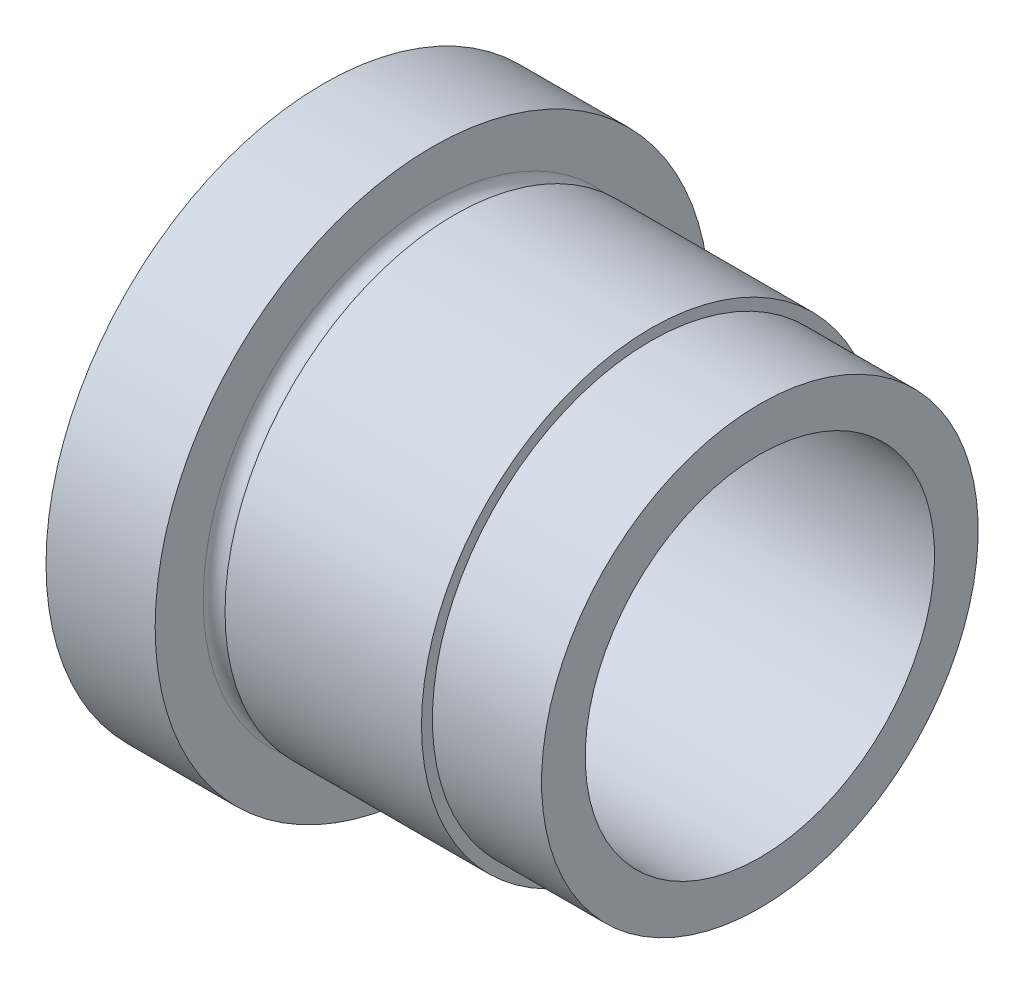
ISO-10303-21;
HEADER;
FILE_DESCRIPTION(('STEP AP214'),'2;1');
FILE_NAME('part.step','',(''),(''),'','','');
FILE_SCHEMA(('AUTOMOTIVE_DESIGN { 1 0 10303 214 1 1 1 1 }'));
ENDSEC;
DATA;
#1=APPLICATION_CONTEXT('core data for automotive mechanical design processes');
#2=APPLICATION_PROTOCOL_DEFINITION('international standard','automotive_design',2000,#1);
#3=PRODUCT_CONTEXT('',#1,'mechanical');
#4=PRODUCT('Part','Part','',(#3));
#5=PRODUCT_RELATED_PRODUCT_CATEGORY('part','',(#4));
#6=PRODUCT_DEFINITION_FORMATION('','',#4);
#7=PRODUCT_DEFINITION_CONTEXT('part definition',#1,'design');
#8=PRODUCT_DEFINITION('design','',#6,#7);
#9=PRODUCT_DEFINITION_SHAPE('','',#8);
#10=(LENGTH_UNIT() NAMED_UNIT(*) SI_UNIT(.MILLI.,.METRE.));
#11=(NAMED_UNIT(*) PLANE_ANGLE_UNIT() SI_UNIT($,.RADIAN.));
#12=(NAMED_UNIT(*) SI_UNIT($,.STERADIAN.) SOLID_ANGLE_UNIT());
#13=UNCERTAINTY_MEASURE_WITH_UNIT(LENGTH_MEASURE(1.E-05),#10,'distance_accuracy_value','');
#14=(GEOMETRIC_REPRESENTATION_CONTEXT(3) GLOBAL_UNCERTAINTY_ASSIGNED_CONTEXT((#13)) GLOBAL_UNIT_ASSIGNED_CONTEXT((#10,
#11,#12)) REPRESENTATION_CONTEXT('',''));
#15=CARTESIAN_POINT('',(0.,0.,0.));
#16=DIRECTION('',(0.,0.,1.));
#17=DIRECTION('',(1.,0.,0.));
#18=AXIS2_PLACEMENT_3D('',#15,#16,#17);
#19=CARTESIAN_POINT('',(-138.925343642612,0.,0.));
#20=DIRECTION('',(-1.,0.,0.));
#21=DIRECTION('',(0.,-1.,0.));
#22=AXIS2_PLACEMENT_3D('',#19,#20,#21);
#23=CYLINDRICAL_SURFACE('',#22,12.7);
#24=CARTESIAN_POINT('',(0.,0.,0.));
#25=DIRECTION('',(-1.,0.,0.));
#26=DIRECTION('',(0.,-1.,0.));
#27=AXIS2_PLACEMENT_3D('',#24,#25,#26);
#28=CIRCLE('',#27,12.7);
#29=CARTESIAN_POINT('',(0.,-12.6999999999999,0.));
#30=VERTEX_POINT('',#29);
#31=EDGE_CURVE('E10',#30,#30,#28,.T.);
#32=ORIENTED_EDGE('',*,*,#31,.F.);
#33=EDGE_LOOP('',(#32));
#34=FACE_BOUND('',#33,.T.);
#35=CARTESIAN_POINT('',(5.,0.,0.));
#36=DIRECTION('',(-1.,0.,0.));
#37=DIRECTION('',(0.,-1.,0.));
#38=AXIS2_PLACEMENT_3D('',#35,#36,#37);
#39=CIRCLE('',#38,12.7);
#40=CARTESIAN_POINT('',(5.00000000000001,-12.6999999999999,0.));
#41=VERTEX_POINT('',#40);
#42=EDGE_CURVE('E65',#41,#41,#39,.T.);
#43=ORIENTED_EDGE('',*,*,#42,.T.);
#44=EDGE_LOOP('',(#43));
#45=FACE_BOUND('',#44,.T.);
#46=ADVANCED_FACE('F28',(#34,#45),#23,.T.);
#47=CARTESIAN_POINT('',(0.,8.05,0.));
#48=DIRECTION('',(1.,0.,0.));
#49=DIRECTION('',(0.,1.,0.));
#50=AXIS2_PLACEMENT_3D('',#47,#48,#49);
#51=PLANE('',#50);
#52=CARTESIAN_POINT('',(0.,0.,0.));
#53=DIRECTION('',(-1.,0.,0.));
#54=DIRECTION('',(0.,-1.,0.));
#55=AXIS2_PLACEMENT_3D('',#52,#53,#54);
#56=CIRCLE('',#55,8.04999999999997);
#57=CARTESIAN_POINT('',(0.,-8.04999999999995,0.));
#58=VERTEX_POINT('',#57);
#59=EDGE_CURVE('E34',#58,#58,#56,.T.);
#60=ORIENTED_EDGE('',*,*,#59,.F.);
#61=EDGE_LOOP('',(#60));
#62=FACE_BOUND('',#61,.T.);
#63=ORIENTED_EDGE('',*,*,#31,.T.);
#64=EDGE_LOOP('',(#63));
#65=FACE_BOUND('',#64,.T.);
#66=ADVANCED_FACE('F120',(#62,#65),#51,.F.);
#67=CARTESIAN_POINT('',(-138.925343642612,0.,0.));
#68=DIRECTION('',(-1.,0.,0.));
#69=DIRECTION('',(0.,-1.,0.));
#70=AXIS2_PLACEMENT_3D('',#67,#68,#69);
#71=CYLINDRICAL_SURFACE('',#70,8.04999999999997);
#72=CARTESIAN_POINT('',(0.100000000000017,0.,0.));
#73=DIRECTION('',(-1.,0.,0.));
#74=DIRECTION('',(0.,-1.,0.));
#75=AXIS2_PLACEMENT_3D('',#72,#73,#74);
#76=CIRCLE('',#75,8.04999999999997);
#77=CARTESIAN_POINT('',(0.100000000000018,-8.04999999999995,0.));
#78=VERTEX_POINT('',#77);
#79=EDGE_CURVE('E38',#78,#78,#76,.T.);
#80=ORIENTED_EDGE('',*,*,#79,.F.);
#81=EDGE_LOOP('',(#80));
#82=FACE_BOUND('',#81,.T.);
#83=ORIENTED_EDGE('',*,*,#59,.T.);
#84=EDGE_LOOP('',(#83));
#85=FACE_BOUND('',#84,.T.);
#86=ADVANCED_FACE('F115',(#82,#85),#71,.F.);
#87=CARTESIAN_POINT('',(0.100000000000003,8.,0.));
#88=DIRECTION('',(1.,0.,0.));
#89=DIRECTION('',(0.,1.,0.));
#90=AXIS2_PLACEMENT_3D('',#87,#88,#89);
#91=PLANE('',#90);
#92=CARTESIAN_POINT('',(0.100000000000017,0.,0.));
#93=DIRECTION('',(-1.,0.,0.));
#94=DIRECTION('',(0.,-1.,0.));
#95=AXIS2_PLACEMENT_3D('',#92,#93,#94);
#96=CIRCLE('',#95,7.99999999999997);
#97=CARTESIAN_POINT('',(0.100000000000018,-7.99999999999995,0.));
#98=VERTEX_POINT('',#97);
#99=EDGE_CURVE('E42',#98,#98,#96,.T.);
#100=ORIENTED_EDGE('',*,*,#99,.F.);
#101=EDGE_LOOP('',(#100));
#102=FACE_BOUND('',#101,.T.);
#103=ORIENTED_EDGE('',*,*,#79,.T.);
#104=EDGE_LOOP('',(#103));
#105=FACE_BOUND('',#104,.T.);
#106=ADVANCED_FACE('F109',(#102,#105),#91,.F.);
#107=CARTESIAN_POINT('',(-138.925343642612,0.,0.));
#108=DIRECTION('',(-1.,0.,0.));
#109=DIRECTION('',(0.,-1.,0.));
#110=AXIS2_PLACEMENT_3D('',#107,#108,#109);
#111=CYLINDRICAL_SURFACE('',#110,7.99999999999997);
#112=CARTESIAN_POINT('',(20.,0.,0.));
#113=DIRECTION('',(-1.,0.,0.));
#114=DIRECTION('',(0.,-1.,0.));
#115=AXIS2_PLACEMENT_3D('',#112,#113,#114);
#116=CIRCLE('',#115,7.99999999999997);
#117=CARTESIAN_POINT('',(20.,-7.99999999999994,0.));
#118=VERTEX_POINT('',#117);
#119=EDGE_CURVE('E47',#118,#118,#116,.T.);
#120=ORIENTED_EDGE('',*,*,#119,.F.);
#121=EDGE_LOOP('',(#120));
#122=FACE_BOUND('',#121,.T.);
#123=ORIENTED_EDGE('',*,*,#99,.T.);
#124=EDGE_LOOP('',(#123));
#125=FACE_BOUND('',#124,.T.);
#126=ADVANCED_FACE('F103',(#122,#125),#111,.F.);
#127=CARTESIAN_POINT('',(20.,10.,0.));
#128=DIRECTION('',(-1.,0.,0.));
#129=DIRECTION('',(0.,-1.,0.));
#130=AXIS2_PLACEMENT_3D('',#127,#128,#129);
#131=PLANE('',#130);
#132=CARTESIAN_POINT('',(20.,0.,0.));
#133=DIRECTION('',(-1.,0.,0.));
#134=DIRECTION('',(0.,-1.,0.));
#135=AXIS2_PLACEMENT_3D('',#132,#133,#134);
#136=CIRCLE('',#135,9.99999999999997);
#137=CARTESIAN_POINT('',(20.,-9.99999999999994,0.));
#138=VERTEX_POINT('',#137);
#139=EDGE_CURVE('E50',#138,#138,#136,.T.);
#140=ORIENTED_EDGE('',*,*,#139,.F.);
#141=EDGE_LOOP('',(#140));
#142=FACE_BOUND('',#141,.T.);
#143=ORIENTED_EDGE('',*,*,#119,.T.);
#144=EDGE_LOOP('',(#143));
#145=FACE_BOUND('',#144,.T.);
#146=ADVANCED_FACE('F97',(#142,#145),#131,.F.);
#147=CARTESIAN_POINT('',(-138.925343642612,0.,0.));
#148=DIRECTION('',(-1.,0.,0.));
#149=DIRECTION('',(0.,-1.,0.));
#150=AXIS2_PLACEMENT_3D('',#147,#148,#149);
#151=CYLINDRICAL_SURFACE('',#150,9.99999999999997);
#152=CARTESIAN_POINT('',(15.,0.,0.));
#153=DIRECTION('',(-1.,0.,0.));
#154=DIRECTION('',(0.,-1.,0.));
#155=AXIS2_PLACEMENT_3D('',#152,#153,#154);
#156=CIRCLE('',#155,9.99999999999997);
#157=CARTESIAN_POINT('',(15.,-9.99999999999994,0.));
#158=VERTEX_POINT('',#157);
#159=EDGE_CURVE('E53',#158,#158,#156,.T.);
#160=ORIENTED_EDGE('',*,*,#159,.F.);
#161=EDGE_LOOP('',(#160));
#162=FACE_BOUND('',#161,.T.);
#163=ORIENTED_EDGE('',*,*,#139,.T.);
#164=EDGE_LOOP('',(#163));
#165=FACE_BOUND('',#164,.T.);
#166=ADVANCED_FACE('F91',(#162,#165),#151,.T.);
#167=CARTESIAN_POINT('',(15.,10.5,0.));
#168=DIRECTION('',(-1.,0.,0.));
#169=DIRECTION('',(0.,-1.,0.));
#170=AXIS2_PLACEMENT_3D('',#167,#168,#169);
#171=PLANE('',#170);
#172=CARTESIAN_POINT('',(15.,0.,0.));
#173=DIRECTION('',(-1.,0.,0.));
#174=DIRECTION('',(0.,-1.,0.));
#175=AXIS2_PLACEMENT_3D('',#172,#173,#174);
#176=CIRCLE('',#175,10.5);
#177=CARTESIAN_POINT('',(15.,-10.4999999999999,0.));
#178=VERTEX_POINT('',#177);
#179=EDGE_CURVE('E56',#178,#178,#176,.T.);
#180=ORIENTED_EDGE('',*,*,#179,.F.);
#181=EDGE_LOOP('',(#180));
#182=FACE_BOUND('',#181,.T.);
#183=ORIENTED_EDGE('',*,*,#159,.T.);
#184=EDGE_LOOP('',(#183));
#185=FACE_BOUND('',#184,.T.);
#186=ADVANCED_FACE('F85',(#182,#185),#171,.F.);
#187=CARTESIAN_POINT('',(-138.925343642612,0.,0.));
#188=DIRECTION('',(-1.,0.,0.));
#189=DIRECTION('',(0.,-1.,0.));
#190=AXIS2_PLACEMENT_3D('',#187,#188,#189);
#191=CYLINDRICAL_SURFACE('',#190,10.5);
#192=CARTESIAN_POINT('',(6.00000000000001,0.,0.));
#193=DIRECTION('',(-1.,0.,0.));
#194=DIRECTION('',(0.,-1.,0.));
#195=AXIS2_PLACEMENT_3D('',#192,#193,#194);
#196=CIRCLE('',#195,10.5);
#197=CARTESIAN_POINT('',(6.00000000000001,-10.5,0.));
#198=VERTEX_POINT('',#197);
#199=EDGE_CURVE('E59',#198,#198,#196,.T.);
#200=ORIENTED_EDGE('',*,*,#199,.F.);
#201=EDGE_LOOP('',(#200));
#202=FACE_BOUND('',#201,.T.);
#203=ORIENTED_EDGE('',*,*,#179,.T.);
#204=EDGE_LOOP('',(#203));
#205=FACE_BOUND('',#204,.T.);
#206=ADVANCED_FACE('F79',(#202,#205),#191,.T.);
#207=CARTESIAN_POINT('',(5.50000000000001,0.,0.));
#208=DIRECTION('',(-1.,0.,0.));
#209=DIRECTION('',(0.,-1.,0.));
#210=AXIS2_PLACEMENT_3D('',#207,#208,#209);
#211=TOROIDAL_SURFACE('',#210,10.5,0.500000000000007);
#212=CARTESIAN_POINT('',(5.,0.,0.));
#213=DIRECTION('',(-1.,0.,0.));
#214=DIRECTION('',(0.,-1.,0.));
#215=AXIS2_PLACEMENT_3D('',#212,#213,#214);
#216=CIRCLE('',#215,10.5);
#217=CARTESIAN_POINT('',(5.00000000000001,-10.5,0.));
#218=VERTEX_POINT('',#217);
#219=EDGE_CURVE('E62',#218,#218,#216,.T.);
#220=ORIENTED_EDGE('',*,*,#219,.F.);
#221=EDGE_LOOP('',(#220));
#222=FACE_BOUND('',#221,.T.);
#223=ORIENTED_EDGE('',*,*,#199,.T.);
#224=EDGE_LOOP('',(#223));
#225=FACE_BOUND('',#224,.T.);
#226=ADVANCED_FACE('F73',(#222,#225),#211,.F.);
#227=CARTESIAN_POINT('',(5.,12.7,0.));
#228=DIRECTION('',(-1.,0.,0.));
#229=DIRECTION('',(0.,-1.,0.));
#230=AXIS2_PLACEMENT_3D('',#227,#228,#229);
#231=PLANE('',#230);
#232=ORIENTED_EDGE('',*,*,#42,.F.);
#233=EDGE_LOOP('',(#232));
#234=FACE_BOUND('',#233,.T.);
#235=ORIENTED_EDGE('',*,*,#219,.T.);
#236=EDGE_LOOP('',(#235));
#237=FACE_BOUND('',#236,.T.);
#238=ADVANCED_FACE('F70',(#234,#237),#231,.F.);
#239=CLOSED_SHELL('',(#46,#66,#86,#106,#126,#146,#166,#186,#206,#226,#238));
#240=MANIFOLD_SOLID_BREP('B2',#239);
#241=ADVANCED_BREP_SHAPE_REPRESENTATION('',(#18,#240),#14);
#242=SHAPE_DEFINITION_REPRESENTATION(#9,#241);
ENDSEC;
END-ISO-10303-21;
